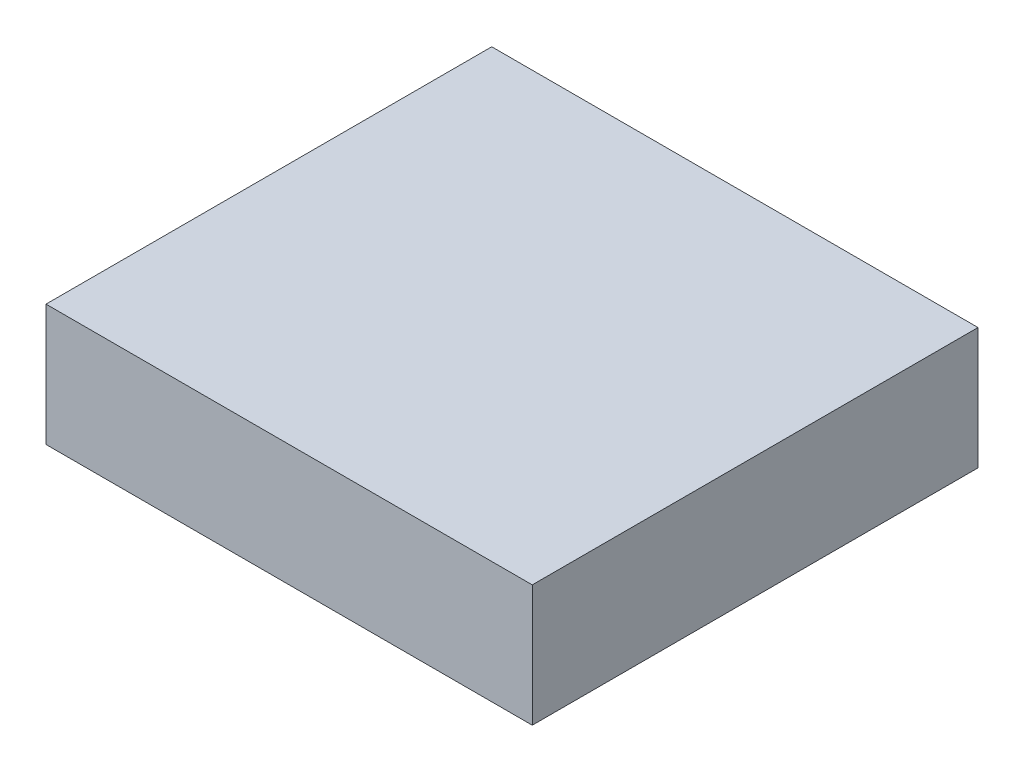
ISO-10303-21;
HEADER;
FILE_DESCRIPTION(('STEP AP214'),'2;1');
FILE_NAME('part.step','',(''),(''),'','','');
FILE_SCHEMA(('AUTOMOTIVE_DESIGN { 1 0 10303 214 1 1 1 1 }'));
ENDSEC;
DATA;
#1=APPLICATION_CONTEXT('core data for automotive mechanical design processes');
#2=APPLICATION_PROTOCOL_DEFINITION('international standard','automotive_design',2000,#1);
#3=PRODUCT_CONTEXT('',#1,'mechanical');
#4=PRODUCT('Part','Part','',(#3));
#5=PRODUCT_RELATED_PRODUCT_CATEGORY('part','',(#4));
#6=PRODUCT_DEFINITION_FORMATION('','',#4);
#7=PRODUCT_DEFINITION_CONTEXT('part definition',#1,'design');
#8=PRODUCT_DEFINITION('design','',#6,#7);
#9=PRODUCT_DEFINITION_SHAPE('','',#8);
#10=(LENGTH_UNIT() NAMED_UNIT(*) SI_UNIT(.MILLI.,.METRE.));
#11=(NAMED_UNIT(*) PLANE_ANGLE_UNIT() SI_UNIT($,.RADIAN.));
#12=(NAMED_UNIT(*) SI_UNIT($,.STERADIAN.) SOLID_ANGLE_UNIT());
#13=UNCERTAINTY_MEASURE_WITH_UNIT(LENGTH_MEASURE(1.E-05),#10,'distance_accuracy_value','');
#14=(GEOMETRIC_REPRESENTATION_CONTEXT(3) GLOBAL_UNCERTAINTY_ASSIGNED_CONTEXT((#13)) GLOBAL_UNIT_ASSIGNED_CONTEXT((#10,
#11,#12)) REPRESENTATION_CONTEXT('',''));
#15=CARTESIAN_POINT('',(0.,0.,0.));
#16=DIRECTION('',(0.,0.,1.));
#17=DIRECTION('',(1.,0.,0.));
#18=AXIS2_PLACEMENT_3D('',#15,#16,#17);
#19=CARTESIAN_POINT('',(0.,38.1,0.));
#20=DIRECTION('',(1.,0.,0.));
#21=DIRECTION('',(0.,0.,-1.));
#22=AXIS2_PLACEMENT_3D('',#19,#20,#21);
#23=PLANE('',#22);
#24=DIRECTION('',(0.,0.,1.));
#25=VECTOR('',#24,1.);
#26=CARTESIAN_POINT('',(0.,0.,0.));
#27=LINE('',#26,#25);
#28=CARTESIAN_POINT('',(0.,0.,-139.7));
#29=VERTEX_POINT('',#28);
#30=CARTESIAN_POINT('',(0.,0.,0.));
#31=VERTEX_POINT('',#30);
#32=EDGE_CURVE('E94',#29,#31,#27,.T.);
#33=ORIENTED_EDGE('',*,*,#32,.T.);
#34=DIRECTION('',(0.,-1.,0.));
#35=VECTOR('',#34,1.);
#36=CARTESIAN_POINT('',(0.,38.1,0.));
#37=LINE('',#36,#35);
#38=CARTESIAN_POINT('',(0.,38.1,0.));
#39=VERTEX_POINT('',#38);
#40=EDGE_CURVE('E11',#39,#31,#37,.T.);
#41=ORIENTED_EDGE('',*,*,#40,.F.);
#42=DIRECTION('',(0.,0.,1.));
#43=VECTOR('',#42,1.);
#44=CARTESIAN_POINT('',(0.,38.1,0.));
#45=LINE('',#44,#43);
#46=CARTESIAN_POINT('',(0.,38.1,-139.7));
#47=VERTEX_POINT('',#46);
#48=EDGE_CURVE('E82',#47,#39,#45,.T.);
#49=ORIENTED_EDGE('',*,*,#48,.F.);
#50=DIRECTION('',(0.,-1.,0.));
#51=VECTOR('',#50,1.);
#52=CARTESIAN_POINT('',(0.,38.1,-139.7));
#53=LINE('',#52,#51);
#54=EDGE_CURVE('E90',#47,#29,#53,.T.);
#55=ORIENTED_EDGE('',*,*,#54,.T.);
#56=EDGE_LOOP('',(#33,#41,#49,#55));
#57=FACE_BOUND('',#56,.T.);
#58=ADVANCED_FACE('F31',(#57),#23,.F.);
#59=CARTESIAN_POINT('',(0.,38.1,0.));
#60=DIRECTION('',(0.,0.,-1.));
#61=DIRECTION('',(-1.,0.,0.));
#62=AXIS2_PLACEMENT_3D('',#59,#60,#61);
#63=PLANE('',#62);
#64=DIRECTION('',(1.,0.,0.));
#65=VECTOR('',#64,1.);
#66=CARTESIAN_POINT('',(0.,0.,0.));
#67=LINE('',#66,#65);
#68=CARTESIAN_POINT('',(152.4,0.,0.));
#69=VERTEX_POINT('',#68);
#70=EDGE_CURVE('E86',#31,#69,#67,.T.);
#71=ORIENTED_EDGE('',*,*,#70,.T.);
#72=DIRECTION('',(0.,-1.,0.));
#73=VECTOR('',#72,1.);
#74=CARTESIAN_POINT('',(152.4,38.1,0.));
#75=LINE('',#74,#73);
#76=CARTESIAN_POINT('',(152.4,38.1,0.));
#77=VERTEX_POINT('',#76);
#78=EDGE_CURVE('E39',#77,#69,#75,.T.);
#79=ORIENTED_EDGE('',*,*,#78,.F.);
#80=DIRECTION('',(1.,0.,0.));
#81=VECTOR('',#80,1.);
#82=CARTESIAN_POINT('',(0.,38.1,0.));
#83=LINE('',#82,#81);
#84=EDGE_CURVE('E77',#39,#77,#83,.T.);
#85=ORIENTED_EDGE('',*,*,#84,.F.);
#86=ORIENTED_EDGE('',*,*,#40,.T.);
#87=EDGE_LOOP('',(#71,#79,#85,#86));
#88=FACE_BOUND('',#87,.T.);
#89=ADVANCED_FACE('F85',(#88),#63,.F.);
#90=CARTESIAN_POINT('',(152.4,38.1,0.));
#91=DIRECTION('',(-1.,0.,0.));
#92=DIRECTION('',(0.,0.,1.));
#93=AXIS2_PLACEMENT_3D('',#90,#91,#92);
#94=PLANE('',#93);
#95=DIRECTION('',(0.,0.,-1.));
#96=VECTOR('',#95,1.);
#97=CARTESIAN_POINT('',(152.4,0.,0.));
#98=LINE('',#97,#96);
#99=CARTESIAN_POINT('',(152.4,0.,-139.7));
#100=VERTEX_POINT('',#99);
#101=EDGE_CURVE('E64',#69,#100,#98,.T.);
#102=ORIENTED_EDGE('',*,*,#101,.T.);
#103=DIRECTION('',(0.,-1.,0.));
#104=VECTOR('',#103,1.);
#105=CARTESIAN_POINT('',(152.4,38.1,-139.7));
#106=LINE('',#105,#104);
#107=CARTESIAN_POINT('',(152.4,38.1,-139.7));
#108=VERTEX_POINT('',#107);
#109=EDGE_CURVE('E87',#108,#100,#106,.T.);
#110=ORIENTED_EDGE('',*,*,#109,.F.);
#111=DIRECTION('',(0.,0.,-1.));
#112=VECTOR('',#111,1.);
#113=CARTESIAN_POINT('',(152.4,38.1,0.));
#114=LINE('',#113,#112);
#115=EDGE_CURVE('E80',#77,#108,#114,.T.);
#116=ORIENTED_EDGE('',*,*,#115,.F.);
#117=ORIENTED_EDGE('',*,*,#78,.T.);
#118=EDGE_LOOP('',(#102,#110,#116,#117));
#119=FACE_BOUND('',#118,.T.);
#120=ADVANCED_FACE('F88',(#119),#94,.F.);
#121=CARTESIAN_POINT('',(0.,38.1,-139.7));
#122=DIRECTION('',(0.,0.,1.));
#123=DIRECTION('',(1.,0.,0.));
#124=AXIS2_PLACEMENT_3D('',#121,#122,#123);
#125=PLANE('',#124);
#126=DIRECTION('',(-1.,0.,0.));
#127=VECTOR('',#126,1.);
#128=CARTESIAN_POINT('',(0.,0.,-139.7));
#129=LINE('',#128,#127);
#130=EDGE_CURVE('E70',#100,#29,#129,.T.);
#131=ORIENTED_EDGE('',*,*,#130,.T.);
#132=ORIENTED_EDGE('',*,*,#54,.F.);
#133=DIRECTION('',(-1.,0.,0.));
#134=VECTOR('',#133,1.);
#135=CARTESIAN_POINT('',(0.,38.1,-139.7));
#136=LINE('',#135,#134);
#137=EDGE_CURVE('E47',#108,#47,#136,.T.);
#138=ORIENTED_EDGE('',*,*,#137,.F.);
#139=ORIENTED_EDGE('',*,*,#109,.T.);
#140=EDGE_LOOP('',(#131,#132,#138,#139));
#141=FACE_BOUND('',#140,.T.);
#142=ADVANCED_FACE('F101',(#141),#125,.F.);
#143=CARTESIAN_POINT('',(0.,38.1,-139.7));
#144=DIRECTION('',(0.,-1.,0.));
#145=DIRECTION('',(0.,0.,-1.));
#146=AXIS2_PLACEMENT_3D('',#143,#144,#145);
#147=PLANE('',#146);
#148=ORIENTED_EDGE('',*,*,#48,.T.);
#149=ORIENTED_EDGE('',*,*,#84,.T.);
#150=ORIENTED_EDGE('',*,*,#115,.T.);
#151=ORIENTED_EDGE('',*,*,#137,.T.);
#152=EDGE_LOOP('',(#148,#149,#150,#151));
#153=FACE_BOUND('',#152,.T.);
#154=ADVANCED_FACE('F78',(#153),#147,.F.);
#155=CARTESIAN_POINT('',(0.,0.,-139.7));
#156=DIRECTION('',(0.,-1.,0.));
#157=DIRECTION('',(0.,0.,-1.));
#158=AXIS2_PLACEMENT_3D('',#155,#156,#157);
#159=PLANE('',#158);
#160=ORIENTED_EDGE('',*,*,#32,.F.);
#161=ORIENTED_EDGE('',*,*,#130,.F.);
#162=ORIENTED_EDGE('',*,*,#101,.F.);
#163=ORIENTED_EDGE('',*,*,#70,.F.);
#164=EDGE_LOOP('',(#160,#161,#162,#163));
#165=FACE_BOUND('',#164,.T.);
#166=ADVANCED_FACE('F104',(#165),#159,.T.);
#167=CLOSED_SHELL('',(#58,#89,#120,#142,#154,#166));
#168=MANIFOLD_SOLID_BREP('B2',#167);
#169=ADVANCED_BREP_SHAPE_REPRESENTATION('',(#18,#168),#14);
#170=SHAPE_DEFINITION_REPRESENTATION(#9,#169);
ENDSEC;
END-ISO-10303-21;
